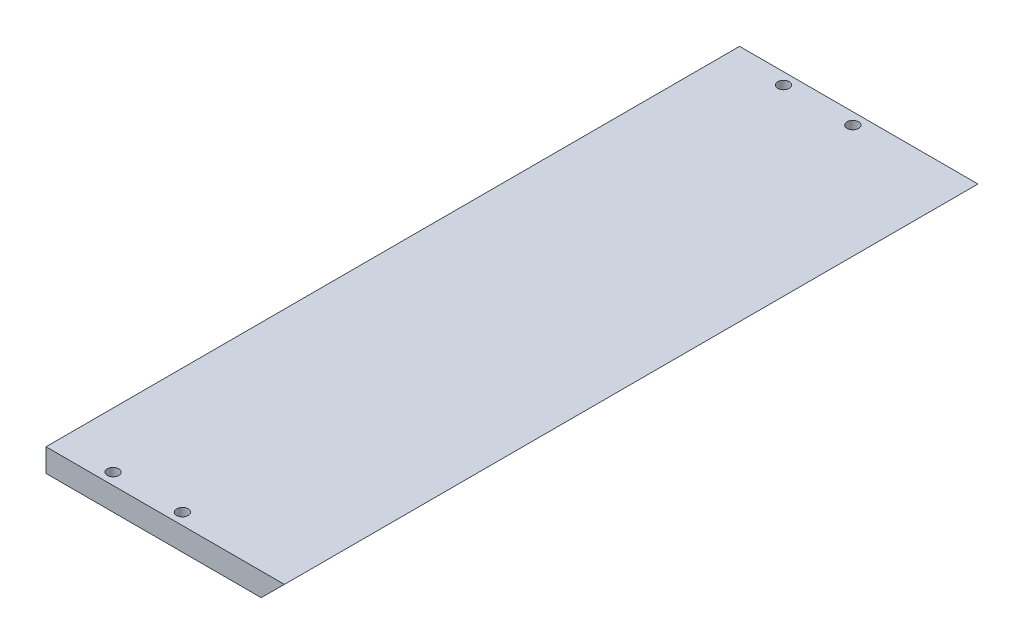
ISO-10303-21;
HEADER;
FILE_DESCRIPTION(('STEP AP214'),'2;1');
FILE_NAME('part.step','',(''),(''),'','','');
FILE_SCHEMA(('AUTOMOTIVE_DESIGN { 1 0 10303 214 1 1 1 1 }'));
ENDSEC;
DATA;
#1=APPLICATION_CONTEXT('core data for automotive mechanical design processes');
#2=APPLICATION_PROTOCOL_DEFINITION('international standard','automotive_design',2000,#1);
#3=PRODUCT_CONTEXT('',#1,'mechanical');
#4=PRODUCT('Part','Part','',(#3));
#5=PRODUCT_RELATED_PRODUCT_CATEGORY('part','',(#4));
#6=PRODUCT_DEFINITION_FORMATION('','',#4);
#7=PRODUCT_DEFINITION_CONTEXT('part definition',#1,'design');
#8=PRODUCT_DEFINITION('design','',#6,#7);
#9=PRODUCT_DEFINITION_SHAPE('','',#8);
#10=(LENGTH_UNIT() NAMED_UNIT(*) SI_UNIT(.MILLI.,.METRE.));
#11=(NAMED_UNIT(*) PLANE_ANGLE_UNIT() SI_UNIT($,.RADIAN.));
#12=(NAMED_UNIT(*) SI_UNIT($,.STERADIAN.) SOLID_ANGLE_UNIT());
#13=UNCERTAINTY_MEASURE_WITH_UNIT(LENGTH_MEASURE(1.E-05),#10,'distance_accuracy_value','');
#14=(GEOMETRIC_REPRESENTATION_CONTEXT(3) GLOBAL_UNCERTAINTY_ASSIGNED_CONTEXT((#13)) GLOBAL_UNIT_ASSIGNED_CONTEXT((#10,
#11,#12)) REPRESENTATION_CONTEXT('',''));
#15=CARTESIAN_POINT('',(0.,0.,0.));
#16=DIRECTION('',(0.,0.,1.));
#17=DIRECTION('',(1.,0.,0.));
#18=AXIS2_PLACEMENT_3D('',#15,#16,#17);
#19=CARTESIAN_POINT('',(0.,5.,75.));
#20=DIRECTION('',(0.,-1.,0.));
#21=DIRECTION('',(0.,0.,-1.));
#22=AXIS2_PLACEMENT_3D('',#19,#20,#21);
#23=PLANE('',#22);
#24=DIRECTION('',(-1.,0.,0.));
#25=VECTOR('',#24,1.);
#26=CARTESIAN_POINT('',(0.,5.,-75.));
#27=LINE('',#26,#25);
#28=CARTESIAN_POINT('',(51.57,5.,-75.));
#29=VERTEX_POINT('',#28);
#30=CARTESIAN_POINT('',(0.,5.,-75.));
#31=VERTEX_POINT('',#30);
#32=EDGE_CURVE('E77',#29,#31,#27,.T.);
#33=ORIENTED_EDGE('',*,*,#32,.T.);
#34=DIRECTION('',(0.,0.,-1.));
#35=VECTOR('',#34,1.);
#36=CARTESIAN_POINT('',(0.,5.,75.));
#37=LINE('',#36,#35);
#38=CARTESIAN_POINT('',(0.,5.,75.));
#39=VERTEX_POINT('',#38);
#40=EDGE_CURVE('E97',#39,#31,#37,.T.);
#41=ORIENTED_EDGE('',*,*,#40,.F.);
#42=DIRECTION('',(-1.,0.,0.));
#43=VECTOR('',#42,1.);
#44=CARTESIAN_POINT('',(0.,5.,75.));
#45=LINE('',#44,#43);
#46=CARTESIAN_POINT('',(51.57,5.,75.));
#47=VERTEX_POINT('',#46);
#48=EDGE_CURVE('E54',#47,#39,#45,.T.);
#49=ORIENTED_EDGE('',*,*,#48,.F.);
#50=DIRECTION('',(0.,0.,-1.));
#51=VECTOR('',#50,1.);
#52=CARTESIAN_POINT('',(51.57,5.,75.));
#53=LINE('',#52,#51);
#54=EDGE_CURVE('E94',#47,#29,#53,.T.);
#55=ORIENTED_EDGE('',*,*,#54,.T.);
#56=EDGE_LOOP('',(#33,#41,#49,#55));
#57=FACE_BOUND('',#56,.T.);
#58=CARTESIAN_POINT('',(27.,5.,72.5));
#59=DIRECTION('',(0.,1.,0.));
#60=DIRECTION('',(0.,0.,1.));
#61=AXIS2_PLACEMENT_3D('',#58,#59,#60);
#62=CIRCLE('',#61,1.24999999999999);
#63=CARTESIAN_POINT('',(27.,5.,73.75));
#64=VERTEX_POINT('',#63);
#65=EDGE_CURVE('E117',#64,#64,#62,.T.);
#66=ORIENTED_EDGE('',*,*,#65,.F.);
#67=EDGE_LOOP('',(#66));
#68=FACE_BOUND('',#67,.T.);
#69=CARTESIAN_POINT('',(12.,5.,72.5));
#70=DIRECTION('',(0.,1.,0.));
#71=DIRECTION('',(0.,0.,1.));
#72=AXIS2_PLACEMENT_3D('',#69,#70,#71);
#73=CIRCLE('',#72,1.24999999999999);
#74=CARTESIAN_POINT('',(12.,5.,73.75));
#75=VERTEX_POINT('',#74);
#76=EDGE_CURVE('E123',#75,#75,#73,.T.);
#77=ORIENTED_EDGE('',*,*,#76,.F.);
#78=EDGE_LOOP('',(#77));
#79=FACE_BOUND('',#78,.T.);
#80=CARTESIAN_POINT('',(27.,5.,-72.5));
#81=DIRECTION('',(0.,1.,0.));
#82=DIRECTION('',(0.,0.,1.));
#83=AXIS2_PLACEMENT_3D('',#80,#81,#82);
#84=CIRCLE('',#83,1.24999999999999);
#85=CARTESIAN_POINT('',(27.,5.,-71.25));
#86=VERTEX_POINT('',#85);
#87=EDGE_CURVE('E129',#86,#86,#84,.T.);
#88=ORIENTED_EDGE('',*,*,#87,.F.);
#89=EDGE_LOOP('',(#88));
#90=FACE_BOUND('',#89,.T.);
#91=CARTESIAN_POINT('',(12.,5.,-72.5));
#92=DIRECTION('',(0.,1.,0.));
#93=DIRECTION('',(0.,0.,1.));
#94=AXIS2_PLACEMENT_3D('',#91,#92,#93);
#95=CIRCLE('',#94,1.24999999999999);
#96=CARTESIAN_POINT('',(12.,5.,-71.25));
#97=VERTEX_POINT('',#96);
#98=EDGE_CURVE('E135',#97,#97,#95,.T.);
#99=ORIENTED_EDGE('',*,*,#98,.F.);
#100=EDGE_LOOP('',(#99));
#101=FACE_BOUND('',#100,.T.);
#102=ADVANCED_FACE('F37',(#57,#68,#79,#90,#101),#23,.F.);
#103=CARTESIAN_POINT('',(0.,0.,75.));
#104=DIRECTION('',(1.,0.,0.));
#105=DIRECTION('',(0.,0.,-1.));
#106=AXIS2_PLACEMENT_3D('',#103,#104,#105);
#107=PLANE('',#106);
#108=DIRECTION('',(0.,-1.,0.));
#109=VECTOR('',#108,1.);
#110=CARTESIAN_POINT('',(0.,0.,-75.));
#111=LINE('',#110,#109);
#112=CARTESIAN_POINT('',(0.,0.,-75.));
#113=VERTEX_POINT('',#112);
#114=EDGE_CURVE('E101',#31,#113,#111,.T.);
#115=ORIENTED_EDGE('',*,*,#114,.T.);
#116=DIRECTION('',(0.,0.,-1.));
#117=VECTOR('',#116,1.);
#118=CARTESIAN_POINT('',(0.,0.,75.));
#119=LINE('',#118,#117);
#120=CARTESIAN_POINT('',(0.,0.,75.));
#121=VERTEX_POINT('',#120);
#122=EDGE_CURVE('E11',#121,#113,#119,.T.);
#123=ORIENTED_EDGE('',*,*,#122,.F.);
#124=DIRECTION('',(0.,-1.,0.));
#125=VECTOR('',#124,1.);
#126=CARTESIAN_POINT('',(0.,0.,75.));
#127=LINE('',#126,#125);
#128=EDGE_CURVE('E89',#39,#121,#127,.T.);
#129=ORIENTED_EDGE('',*,*,#128,.F.);
#130=ORIENTED_EDGE('',*,*,#40,.T.);
#131=EDGE_LOOP('',(#115,#123,#129,#130));
#132=FACE_BOUND('',#131,.T.);
#133=ADVANCED_FACE('F39',(#132),#107,.F.);
#134=CARTESIAN_POINT('',(0.,0.,75.));
#135=DIRECTION('',(0.,1.,0.));
#136=DIRECTION('',(0.,0.,1.));
#137=AXIS2_PLACEMENT_3D('',#134,#135,#136);
#138=PLANE('',#137);
#139=CARTESIAN_POINT('',(12.,0.,-72.5));
#140=DIRECTION('',(0.,1.,0.));
#141=DIRECTION('',(0.,0.,1.));
#142=AXIS2_PLACEMENT_3D('',#139,#140,#141);
#143=CIRCLE('',#142,1.25);
#144=CARTESIAN_POINT('',(12.,0.,-71.25));
#145=VERTEX_POINT('',#144);
#146=EDGE_CURVE('E132',#145,#145,#143,.T.);
#147=ORIENTED_EDGE('',*,*,#146,.T.);
#148=EDGE_LOOP('',(#147));
#149=FACE_BOUND('',#148,.T.);
#150=CARTESIAN_POINT('',(27.,0.,-72.5));
#151=DIRECTION('',(0.,1.,0.));
#152=DIRECTION('',(0.,0.,1.));
#153=AXIS2_PLACEMENT_3D('',#150,#151,#152);
#154=CIRCLE('',#153,1.25);
#155=CARTESIAN_POINT('',(27.,0.,-71.25));
#156=VERTEX_POINT('',#155);
#157=EDGE_CURVE('E126',#156,#156,#154,.T.);
#158=ORIENTED_EDGE('',*,*,#157,.T.);
#159=EDGE_LOOP('',(#158));
#160=FACE_BOUND('',#159,.T.);
#161=CARTESIAN_POINT('',(12.,0.,72.5));
#162=DIRECTION('',(0.,1.,0.));
#163=DIRECTION('',(0.,0.,1.));
#164=AXIS2_PLACEMENT_3D('',#161,#162,#163);
#165=CIRCLE('',#164,1.25);
#166=CARTESIAN_POINT('',(12.,0.,73.75));
#167=VERTEX_POINT('',#166);
#168=EDGE_CURVE('E120',#167,#167,#165,.T.);
#169=ORIENTED_EDGE('',*,*,#168,.T.);
#170=EDGE_LOOP('',(#169));
#171=FACE_BOUND('',#170,.T.);
#172=CARTESIAN_POINT('',(27.,0.,72.5));
#173=DIRECTION('',(0.,1.,0.));
#174=DIRECTION('',(0.,0.,1.));
#175=AXIS2_PLACEMENT_3D('',#172,#173,#174);
#176=CIRCLE('',#175,1.25);
#177=CARTESIAN_POINT('',(27.,0.,73.75));
#178=VERTEX_POINT('',#177);
#179=EDGE_CURVE('E104',#178,#178,#176,.T.);
#180=ORIENTED_EDGE('',*,*,#179,.T.);
#181=EDGE_LOOP('',(#180));
#182=FACE_BOUND('',#181,.T.);
#183=DIRECTION('',(1.,0.,0.));
#184=VECTOR('',#183,1.);
#185=CARTESIAN_POINT('',(0.,0.,-75.));
#186=LINE('',#185,#184);
#187=CARTESIAN_POINT('',(46.53,0.,-75.));
#188=VERTEX_POINT('',#187);
#189=EDGE_CURVE('E93',#113,#188,#186,.T.);
#190=ORIENTED_EDGE('',*,*,#189,.T.);
#191=DIRECTION('',(0.,0.,-1.));
#192=VECTOR('',#191,1.);
#193=CARTESIAN_POINT('',(46.53,0.,75.));
#194=LINE('',#193,#192);
#195=CARTESIAN_POINT('',(46.53,0.,75.));
#196=VERTEX_POINT('',#195);
#197=EDGE_CURVE('E46',#196,#188,#194,.T.);
#198=ORIENTED_EDGE('',*,*,#197,.F.);
#199=DIRECTION('',(1.,0.,0.));
#200=VECTOR('',#199,1.);
#201=CARTESIAN_POINT('',(0.,0.,75.));
#202=LINE('',#201,#200);
#203=EDGE_CURVE('E84',#121,#196,#202,.T.);
#204=ORIENTED_EDGE('',*,*,#203,.F.);
#205=ORIENTED_EDGE('',*,*,#122,.T.);
#206=EDGE_LOOP('',(#190,#198,#204,#205));
#207=FACE_BOUND('',#206,.T.);
#208=ADVANCED_FACE('F92',(#149,#160,#171,#182,#207),#138,.F.);
#209=CARTESIAN_POINT('',(51.57,5.,75.));
#210=DIRECTION('',(-0.704284033250847,0.709918305516853,0.));
#211=DIRECTION('',(-0.709918305516853,-0.704284033250847,0.));
#212=AXIS2_PLACEMENT_3D('',#209,#210,#211);
#213=PLANE('',#212);
#214=DIRECTION('',(0.709918305516853,0.704284033250847,0.));
#215=VECTOR('',#214,1.);
#216=CARTESIAN_POINT('',(51.57,5.,-75.));
#217=LINE('',#216,#215);
#218=EDGE_CURVE('E71',#188,#29,#217,.T.);
#219=ORIENTED_EDGE('',*,*,#218,.T.);
#220=ORIENTED_EDGE('',*,*,#54,.F.);
#221=DIRECTION('',(0.709918305516853,0.704284033250847,0.));
#222=VECTOR('',#221,1.);
#223=CARTESIAN_POINT('',(51.57,5.,75.));
#224=LINE('',#223,#222);
#225=EDGE_CURVE('E87',#196,#47,#224,.T.);
#226=ORIENTED_EDGE('',*,*,#225,.F.);
#227=ORIENTED_EDGE('',*,*,#197,.T.);
#228=EDGE_LOOP('',(#219,#220,#226,#227));
#229=FACE_BOUND('',#228,.T.);
#230=ADVANCED_FACE('F95',(#229),#213,.F.);
#231=CARTESIAN_POINT('',(0.,0.,75.));
#232=DIRECTION('',(0.,0.,-1.));
#233=DIRECTION('',(-1.,0.,0.));
#234=AXIS2_PLACEMENT_3D('',#231,#232,#233);
#235=PLANE('',#234);
#236=ORIENTED_EDGE('',*,*,#128,.T.);
#237=ORIENTED_EDGE('',*,*,#203,.T.);
#238=ORIENTED_EDGE('',*,*,#225,.T.);
#239=ORIENTED_EDGE('',*,*,#48,.T.);
#240=EDGE_LOOP('',(#236,#237,#238,#239));
#241=FACE_BOUND('',#240,.T.);
#242=ADVANCED_FACE('F85',(#241),#235,.F.);
#243=CARTESIAN_POINT('',(0.,0.,-75.));
#244=DIRECTION('',(0.,0.,-1.));
#245=DIRECTION('',(-1.,0.,0.));
#246=AXIS2_PLACEMENT_3D('',#243,#244,#245);
#247=PLANE('',#246);
#248=ORIENTED_EDGE('',*,*,#114,.F.);
#249=ORIENTED_EDGE('',*,*,#32,.F.);
#250=ORIENTED_EDGE('',*,*,#218,.F.);
#251=ORIENTED_EDGE('',*,*,#189,.F.);
#252=EDGE_LOOP('',(#248,#249,#250,#251));
#253=FACE_BOUND('',#252,.T.);
#254=ADVANCED_FACE('F112',(#253),#247,.T.);
#255=CARTESIAN_POINT('',(27.,5.,72.5));
#256=DIRECTION('',(0.,1.,0.));
#257=DIRECTION('',(0.,0.,1.));
#258=AXIS2_PLACEMENT_3D('',#255,#256,#257);
#259=CYLINDRICAL_SURFACE('',#258,1.24999999999999);
#260=ORIENTED_EDGE('',*,*,#179,.F.);
#261=EDGE_LOOP('',(#260));
#262=FACE_BOUND('',#261,.T.);
#263=ORIENTED_EDGE('',*,*,#65,.T.);
#264=EDGE_LOOP('',(#263));
#265=FACE_BOUND('',#264,.T.);
#266=ADVANCED_FACE('F162',(#262,#265),#259,.F.);
#267=CARTESIAN_POINT('',(12.,5.,72.5));
#268=DIRECTION('',(0.,1.,0.));
#269=DIRECTION('',(0.,0.,1.));
#270=AXIS2_PLACEMENT_3D('',#267,#268,#269);
#271=CYLINDRICAL_SURFACE('',#270,1.24999999999999);
#272=ORIENTED_EDGE('',*,*,#168,.F.);
#273=EDGE_LOOP('',(#272));
#274=FACE_BOUND('',#273,.T.);
#275=ORIENTED_EDGE('',*,*,#76,.T.);
#276=EDGE_LOOP('',(#275));
#277=FACE_BOUND('',#276,.T.);
#278=ADVANCED_FACE('F165',(#274,#277),#271,.F.);
#279=CARTESIAN_POINT('',(27.,5.,-72.5));
#280=DIRECTION('',(0.,1.,0.));
#281=DIRECTION('',(0.,0.,1.));
#282=AXIS2_PLACEMENT_3D('',#279,#280,#281);
#283=CYLINDRICAL_SURFACE('',#282,1.24999999999999);
#284=ORIENTED_EDGE('',*,*,#157,.F.);
#285=EDGE_LOOP('',(#284));
#286=FACE_BOUND('',#285,.T.);
#287=ORIENTED_EDGE('',*,*,#87,.T.);
#288=EDGE_LOOP('',(#287));
#289=FACE_BOUND('',#288,.T.);
#290=ADVANCED_FACE('F173',(#286,#289),#283,.F.);
#291=CARTESIAN_POINT('',(12.,5.,-72.5));
#292=DIRECTION('',(0.,1.,0.));
#293=DIRECTION('',(0.,0.,1.));
#294=AXIS2_PLACEMENT_3D('',#291,#292,#293);
#295=CYLINDRICAL_SURFACE('',#294,1.24999999999999);
#296=ORIENTED_EDGE('',*,*,#146,.F.);
#297=EDGE_LOOP('',(#296));
#298=FACE_BOUND('',#297,.T.);
#299=ORIENTED_EDGE('',*,*,#98,.T.);
#300=EDGE_LOOP('',(#299));
#301=FACE_BOUND('',#300,.T.);
#302=ADVANCED_FACE('F139',(#298,#301),#295,.F.);
#303=CLOSED_SHELL('',(#102,#133,#208,#230,#242,#254,#266,#278,#290,#302));
#304=MANIFOLD_SOLID_BREP('B2',#303);
#305=ADVANCED_BREP_SHAPE_REPRESENTATION('',(#18,#304),#14);
#306=SHAPE_DEFINITION_REPRESENTATION(#9,#305);
ENDSEC;
END-ISO-10303-21;
